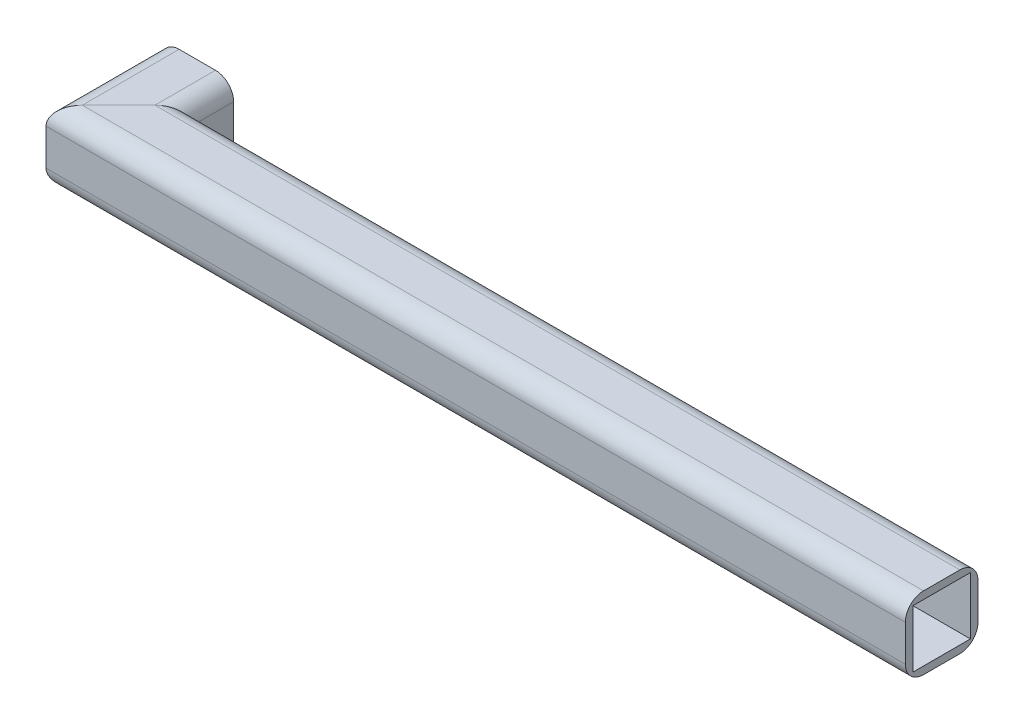
ISO-10303-21;
HEADER;
FILE_DESCRIPTION(('STEP AP214'),'2;1');
FILE_NAME('part.step','',(''),(''),'','','');
FILE_SCHEMA(('AUTOMOTIVE_DESIGN { 1 0 10303 214 1 1 1 1 }'));
ENDSEC;
DATA;
#1=APPLICATION_CONTEXT('core data for automotive mechanical design processes');
#2=APPLICATION_PROTOCOL_DEFINITION('international standard','automotive_design',2000,#1);
#3=PRODUCT_CONTEXT('',#1,'mechanical');
#4=PRODUCT('Part','Part','',(#3));
#5=PRODUCT_RELATED_PRODUCT_CATEGORY('part','',(#4));
#6=PRODUCT_DEFINITION_FORMATION('','',#4);
#7=PRODUCT_DEFINITION_CONTEXT('part definition',#1,'design');
#8=PRODUCT_DEFINITION('design','',#6,#7);
#9=PRODUCT_DEFINITION_SHAPE('','',#8);
#10=(LENGTH_UNIT() NAMED_UNIT(*) SI_UNIT(.MILLI.,.METRE.));
#11=(NAMED_UNIT(*) PLANE_ANGLE_UNIT() SI_UNIT($,.RADIAN.));
#12=(NAMED_UNIT(*) SI_UNIT($,.STERADIAN.) SOLID_ANGLE_UNIT());
#13=UNCERTAINTY_MEASURE_WITH_UNIT(LENGTH_MEASURE(1.E-05),#10,'distance_accuracy_value','');
#14=(GEOMETRIC_REPRESENTATION_CONTEXT(3) GLOBAL_UNCERTAINTY_ASSIGNED_CONTEXT((#13)) GLOBAL_UNIT_ASSIGNED_CONTEXT((#10,
#11,#12)) REPRESENTATION_CONTEXT('',''));
#15=CARTESIAN_POINT('',(0.,0.,0.));
#16=DIRECTION('',(0.,0.,1.));
#17=DIRECTION('',(1.,0.,0.));
#18=AXIS2_PLACEMENT_3D('',#15,#16,#17);
#19=CARTESIAN_POINT('',(-23.5950000000001,98.4249999999997,241.3));
#20=DIRECTION('',(0.,0.,1.));
#21=DIRECTION('',(0.,-1.,0.));
#22=AXIS2_PLACEMENT_3D('',#19,#20,#21);
#23=PLANE('',#22);
#24=DIRECTION('',(0.,1.,0.));
#25=VECTOR('',#24,1.);
#26=CARTESIAN_POINT('',(-15.875,98.4249999999997,241.3));
#27=LINE('',#26,#25);
#28=CARTESIAN_POINT('',(-15.875,22.2250000000003,241.3));
#29=VERTEX_POINT('',#28);
#30=CARTESIAN_POINT('',(-15.875,98.4249999999997,241.3));
#31=VERTEX_POINT('',#30);
#32=EDGE_CURVE('E199',#29,#31,#27,.T.);
#33=ORIENTED_EDGE('',*,*,#32,.F.);
#34=DIRECTION('',(1.,0.,0.));
#35=VECTOR('',#34,1.);
#36=CARTESIAN_POINT('',(-23.5950000000001,22.2250000000003,241.3));
#37=LINE('',#36,#35);
#38=CARTESIAN_POINT('',(1787.525,22.2250000000003,241.3));
#39=VERTEX_POINT('',#38);
#40=EDGE_CURVE('E155',#29,#39,#37,.T.);
#41=ORIENTED_EDGE('',*,*,#40,.T.);
#42=DIRECTION('',(0.,-1.,0.));
#43=VECTOR('',#42,1.);
#44=CARTESIAN_POINT('',(1787.525,98.4249999999997,241.3));
#45=LINE('',#44,#43);
#46=CARTESIAN_POINT('',(1787.525,98.4249999999997,241.3));
#47=VERTEX_POINT('',#46);
#48=EDGE_CURVE('E252',#47,#39,#45,.T.);
#49=ORIENTED_EDGE('',*,*,#48,.F.);
#50=DIRECTION('',(1.,0.,0.));
#51=VECTOR('',#50,1.);
#52=CARTESIAN_POINT('',(-23.5950000000001,98.4249999999997,241.3));
#53=LINE('',#52,#51);
#54=EDGE_CURVE('E39',#31,#47,#53,.T.);
#55=ORIENTED_EDGE('',*,*,#54,.F.);
#56=EDGE_LOOP('',(#33,#41,#49,#55));
#57=FACE_BOUND('',#56,.T.);
#58=ADVANCED_FACE('F35',(#57),#23,.T.);
#59=CARTESIAN_POINT('',(-23.5950000000001,22.225,203.2));
#60=DIRECTION('',(1.,0.,0.));
#61=DIRECTION('',(0.,0.,-1.));
#62=AXIS2_PLACEMENT_3D('',#59,#60,#61);
#63=CYLINDRICAL_SURFACE('',#62,38.1);
#64=CARTESIAN_POINT('',(22.225,22.225,203.2));
#65=DIRECTION('',(0.707106781186547,0.,0.707106781186547));
#66=DIRECTION('',(-0.707106781186548,0.,0.707106781186548));
#67=AXIS2_PLACEMENT_3D('',#64,#65,#66);
#68=ELLIPSE('',#67,53.8815367264149,38.1);
#69=CARTESIAN_POINT('',(22.2250000000003,-15.875,203.2));
#70=VERTEX_POINT('',#69);
#71=EDGE_CURVE('E150',#70,#29,#68,.F.);
#72=ORIENTED_EDGE('',*,*,#71,.F.);
#73=DIRECTION('',(1.,0.,0.));
#74=VECTOR('',#73,1.);
#75=CARTESIAN_POINT('',(-23.5950000000001,-15.875,203.2));
#76=LINE('',#75,#74);
#77=CARTESIAN_POINT('',(1787.525,-15.875,203.2));
#78=VERTEX_POINT('',#77);
#79=EDGE_CURVE('E152',#70,#78,#76,.T.);
#80=ORIENTED_EDGE('',*,*,#79,.T.);
#81=CARTESIAN_POINT('',(1787.525,22.225,203.2));
#82=DIRECTION('',(1.,0.,0.));
#83=DIRECTION('',(0.,0.,-1.));
#84=AXIS2_PLACEMENT_3D('',#81,#82,#83);
#85=CIRCLE('',#84,38.1);
#86=EDGE_CURVE('E160',#39,#78,#85,.T.);
#87=ORIENTED_EDGE('',*,*,#86,.F.);
#88=ORIENTED_EDGE('',*,*,#40,.F.);
#89=EDGE_LOOP('',(#72,#80,#87,#88));
#90=FACE_BOUND('',#89,.T.);
#91=ADVANCED_FACE('F151',(#90),#63,.T.);
#92=CARTESIAN_POINT('',(-23.5950000000001,-15.875,203.2));
#93=DIRECTION('',(0.,-1.,0.));
#94=DIRECTION('',(0.,0.,-1.));
#95=AXIS2_PLACEMENT_3D('',#92,#93,#94);
#96=PLANE('',#95);
#97=DIRECTION('',(-0.707106781186548,0.,0.707106781186548));
#98=VECTOR('',#97,1.);
#99=CARTESIAN_POINT('',(123.825,-15.875,101.6));
#100=LINE('',#99,#98);
#101=CARTESIAN_POINT('',(98.4249999999998,-15.875,127.));
#102=VERTEX_POINT('',#101);
#103=EDGE_CURVE('E143',#102,#70,#100,.T.);
#104=ORIENTED_EDGE('',*,*,#103,.F.);
#105=DIRECTION('',(1.,0.,0.));
#106=VECTOR('',#105,1.);
#107=CARTESIAN_POINT('',(-23.5950000000001,-15.875,127.));
#108=LINE('',#107,#106);
#109=CARTESIAN_POINT('',(1787.525,-15.875,127.));
#110=VERTEX_POINT('',#109);
#111=EDGE_CURVE('E165',#102,#110,#108,.T.);
#112=ORIENTED_EDGE('',*,*,#111,.T.);
#113=DIRECTION('',(0.,0.,-1.));
#114=VECTOR('',#113,1.);
#115=CARTESIAN_POINT('',(1787.525,-15.875,203.2));
#116=LINE('',#115,#114);
#117=EDGE_CURVE('E164',#78,#110,#116,.T.);
#118=ORIENTED_EDGE('',*,*,#117,.F.);
#119=ORIENTED_EDGE('',*,*,#79,.F.);
#120=EDGE_LOOP('',(#104,#112,#118,#119));
#121=FACE_BOUND('',#120,.T.);
#122=ADVANCED_FACE('F162',(#121),#96,.T.);
#123=CARTESIAN_POINT('',(-23.5950000000001,22.225,127.));
#124=DIRECTION('',(1.,0.,0.));
#125=DIRECTION('',(0.,0.,-1.));
#126=AXIS2_PLACEMENT_3D('',#123,#124,#125);
#127=CYLINDRICAL_SURFACE('',#126,38.1);
#128=CARTESIAN_POINT('',(98.425,22.225,127.));
#129=DIRECTION('',(0.707106781186547,0.,0.707106781186547));
#130=DIRECTION('',(-0.707106781186548,0.,0.707106781186548));
#131=AXIS2_PLACEMENT_3D('',#128,#129,#130);
#132=ELLIPSE('',#131,53.8815367264149,38.1);
#133=CARTESIAN_POINT('',(136.525,22.2250000000003,88.8999999999999));
#134=VERTEX_POINT('',#133);
#135=EDGE_CURVE('E175',#134,#102,#132,.F.);
#136=ORIENTED_EDGE('',*,*,#135,.F.);
#137=DIRECTION('',(1.,0.,0.));
#138=VECTOR('',#137,1.);
#139=CARTESIAN_POINT('',(-23.5950000000001,22.2250000000003,88.8999999999999));
#140=LINE('',#139,#138);
#141=CARTESIAN_POINT('',(1787.525,22.2250000000003,88.8999999999999));
#142=VERTEX_POINT('',#141);
#143=EDGE_CURVE('E212',#134,#142,#140,.T.);
#144=ORIENTED_EDGE('',*,*,#143,.T.);
#145=CARTESIAN_POINT('',(1787.525,22.225,127.));
#146=DIRECTION('',(1.,0.,0.));
#147=DIRECTION('',(0.,0.,-1.));
#148=AXIS2_PLACEMENT_3D('',#145,#146,#147);
#149=CIRCLE('',#148,38.1);
#150=EDGE_CURVE('E261',#110,#142,#149,.T.);
#151=ORIENTED_EDGE('',*,*,#150,.F.);
#152=ORIENTED_EDGE('',*,*,#111,.F.);
#153=EDGE_LOOP('',(#136,#144,#151,#152));
#154=FACE_BOUND('',#153,.T.);
#155=ADVANCED_FACE('F304',(#154),#127,.T.);
#156=CARTESIAN_POINT('',(-23.5950000000001,98.4249999999997,88.8999999999999));
#157=DIRECTION('',(0.,0.,-1.));
#158=DIRECTION('',(-1.,0.,0.));
#159=AXIS2_PLACEMENT_3D('',#156,#157,#158);
#160=PLANE('',#159);
#161=DIRECTION('',(0.,-1.,0.));
#162=VECTOR('',#161,1.);
#163=CARTESIAN_POINT('',(136.525,98.4249999999997,88.9));
#164=LINE('',#163,#162);
#165=CARTESIAN_POINT('',(136.525,98.4249999999998,88.8999999999999));
#166=VERTEX_POINT('',#165);
#167=EDGE_CURVE('E276',#166,#134,#164,.T.);
#168=ORIENTED_EDGE('',*,*,#167,.F.);
#169=DIRECTION('',(1.,0.,0.));
#170=VECTOR('',#169,1.);
#171=CARTESIAN_POINT('',(-23.5950000000001,98.4249999999998,88.8999999999999));
#172=LINE('',#171,#170);
#173=CARTESIAN_POINT('',(1787.525,98.4249999999998,88.8999999999999));
#174=VERTEX_POINT('',#173);
#175=EDGE_CURVE('E209',#166,#174,#172,.T.);
#176=ORIENTED_EDGE('',*,*,#175,.T.);
#177=DIRECTION('',(0.,1.,0.));
#178=VECTOR('',#177,1.);
#179=CARTESIAN_POINT('',(1787.525,98.4249999999997,88.8999999999999));
#180=LINE('',#179,#178);
#181=EDGE_CURVE('E264',#142,#174,#180,.T.);
#182=ORIENTED_EDGE('',*,*,#181,.F.);
#183=ORIENTED_EDGE('',*,*,#143,.F.);
#184=EDGE_LOOP('',(#168,#176,#182,#183));
#185=FACE_BOUND('',#184,.T.);
#186=ADVANCED_FACE('F306',(#185),#160,.T.);
#187=CARTESIAN_POINT('',(-23.5950000000001,98.425,127.));
#188=DIRECTION('',(1.,0.,0.));
#189=DIRECTION('',(0.,0.,-1.));
#190=AXIS2_PLACEMENT_3D('',#187,#188,#189);
#191=CYLINDRICAL_SURFACE('',#190,38.1);
#192=CARTESIAN_POINT('',(98.425,98.425,127.));
#193=DIRECTION('',(0.707106781186547,0.,0.707106781186547));
#194=DIRECTION('',(-0.707106781186548,0.,0.707106781186548));
#195=AXIS2_PLACEMENT_3D('',#192,#193,#194);
#196=ELLIPSE('',#195,53.8815367264149,38.1);
#197=CARTESIAN_POINT('',(98.4249999999998,136.525,127.));
#198=VERTEX_POINT('',#197);
#199=EDGE_CURVE('E279',#198,#166,#196,.F.);
#200=ORIENTED_EDGE('',*,*,#199,.F.);
#201=DIRECTION('',(1.,0.,0.));
#202=VECTOR('',#201,1.);
#203=CARTESIAN_POINT('',(-23.5950000000001,136.525,127.));
#204=LINE('',#203,#202);
#205=CARTESIAN_POINT('',(1787.525,136.525,127.));
#206=VERTEX_POINT('',#205);
#207=EDGE_CURVE('E206',#198,#206,#204,.T.);
#208=ORIENTED_EDGE('',*,*,#207,.T.);
#209=CARTESIAN_POINT('',(1787.525,98.425,127.));
#210=DIRECTION('',(1.,0.,0.));
#211=DIRECTION('',(0.,0.,1.));
#212=AXIS2_PLACEMENT_3D('',#209,#210,#211);
#213=CIRCLE('',#212,38.1);
#214=EDGE_CURVE('E269',#174,#206,#213,.T.);
#215=ORIENTED_EDGE('',*,*,#214,.F.);
#216=ORIENTED_EDGE('',*,*,#175,.F.);
#217=EDGE_LOOP('',(#200,#208,#215,#216));
#218=FACE_BOUND('',#217,.T.);
#219=ADVANCED_FACE('F379',(#218),#191,.T.);
#220=CARTESIAN_POINT('',(-23.5950000000001,136.525,203.2));
#221=DIRECTION('',(0.,1.,0.));
#222=DIRECTION('',(0.,0.,1.));
#223=AXIS2_PLACEMENT_3D('',#220,#221,#222);
#224=PLANE('',#223);
#225=DIRECTION('',(0.707106781186548,0.,-0.707106781186548));
#226=VECTOR('',#225,1.);
#227=CARTESIAN_POINT('',(123.825,136.525,101.6));
#228=LINE('',#227,#226);
#229=CARTESIAN_POINT('',(22.2250000000003,136.525,203.2));
#230=VERTEX_POINT('',#229);
#231=EDGE_CURVE('E282',#230,#198,#228,.T.);
#232=ORIENTED_EDGE('',*,*,#231,.F.);
#233=DIRECTION('',(1.,0.,0.));
#234=VECTOR('',#233,1.);
#235=CARTESIAN_POINT('',(-23.5950000000001,136.525,203.2));
#236=LINE('',#235,#234);
#237=CARTESIAN_POINT('',(1787.525,136.525,203.2));
#238=VERTEX_POINT('',#237);
#239=EDGE_CURVE('E203',#230,#238,#236,.T.);
#240=ORIENTED_EDGE('',*,*,#239,.T.);
#241=DIRECTION('',(0.,0.,1.));
#242=VECTOR('',#241,1.);
#243=CARTESIAN_POINT('',(1787.525,136.525,203.2));
#244=LINE('',#243,#242);
#245=EDGE_CURVE('E260',#206,#238,#244,.T.);
#246=ORIENTED_EDGE('',*,*,#245,.F.);
#247=ORIENTED_EDGE('',*,*,#207,.F.);
#248=EDGE_LOOP('',(#232,#240,#246,#247));
#249=FACE_BOUND('',#248,.T.);
#250=ADVANCED_FACE('F375',(#249),#224,.T.);
#251=CARTESIAN_POINT('',(-23.5950000000001,98.425,203.2));
#252=DIRECTION('',(1.,0.,0.));
#253=DIRECTION('',(0.,0.,-1.));
#254=AXIS2_PLACEMENT_3D('',#251,#252,#253);
#255=CYLINDRICAL_SURFACE('',#254,38.1);
#256=CARTESIAN_POINT('',(22.225,98.425,203.2));
#257=DIRECTION('',(0.707106781186547,0.,0.707106781186547));
#258=DIRECTION('',(-0.707106781186548,0.,0.707106781186548));
#259=AXIS2_PLACEMENT_3D('',#256,#257,#258);
#260=ELLIPSE('',#259,53.8815367264149,38.1);
#261=EDGE_CURVE('E202',#31,#230,#260,.F.);
#262=ORIENTED_EDGE('',*,*,#261,.F.);
#263=ORIENTED_EDGE('',*,*,#54,.T.);
#264=CARTESIAN_POINT('',(1787.525,98.425,203.2));
#265=DIRECTION('',(1.,0.,0.));
#266=DIRECTION('',(0.,0.,-1.));
#267=AXIS2_PLACEMENT_3D('',#264,#265,#266);
#268=CIRCLE('',#267,38.1);
#269=EDGE_CURVE('E258',#238,#47,#268,.T.);
#270=ORIENTED_EDGE('',*,*,#269,.F.);
#271=ORIENTED_EDGE('',*,*,#239,.F.);
#272=EDGE_LOOP('',(#262,#263,#270,#271));
#273=FACE_BOUND('',#272,.T.);
#274=ADVANCED_FACE('F37',(#273),#255,.T.);
#275=CARTESIAN_POINT('',(22.225,98.425,0.));
#276=DIRECTION('',(0.,0.,1.));
#277=DIRECTION('',(1.,0.,0.));
#278=AXIS2_PLACEMENT_3D('',#275,#276,#277);
#279=CYLINDRICAL_SURFACE('',#278,38.1);
#280=DIRECTION('',(0.,0.,1.));
#281=VECTOR('',#280,1.);
#282=CARTESIAN_POINT('',(-15.875,98.4249999999997,0.));
#283=LINE('',#282,#281);
#284=CARTESIAN_POINT('',(-15.875,98.4249999999997,0.));
#285=VERTEX_POINT('',#284);
#286=EDGE_CURVE('E184',#285,#31,#283,.T.);
#287=ORIENTED_EDGE('',*,*,#286,.T.);
#288=ORIENTED_EDGE('',*,*,#261,.T.);
#289=DIRECTION('',(0.,0.,1.));
#290=VECTOR('',#289,1.);
#291=CARTESIAN_POINT('',(22.2250000000003,136.525,0.));
#292=LINE('',#291,#290);
#293=CARTESIAN_POINT('',(22.2250000000003,136.525,0.));
#294=VERTEX_POINT('',#293);
#295=EDGE_CURVE('E196',#294,#230,#292,.T.);
#296=ORIENTED_EDGE('',*,*,#295,.F.);
#297=CARTESIAN_POINT('',(22.225,98.425,0.));
#298=DIRECTION('',(0.,0.,1.));
#299=DIRECTION('',(1.,0.,0.));
#300=AXIS2_PLACEMENT_3D('',#297,#298,#299);
#301=CIRCLE('',#300,38.1);
#302=EDGE_CURVE('E228',#294,#285,#301,.T.);
#303=ORIENTED_EDGE('',*,*,#302,.T.);
#304=EDGE_LOOP('',(#287,#288,#296,#303));
#305=FACE_BOUND('',#304,.T.);
#306=ADVANCED_FACE('F225',(#305),#279,.T.);
#307=CARTESIAN_POINT('',(22.2250000000003,136.525,0.));
#308=DIRECTION('',(0.,1.,0.));
#309=DIRECTION('',(0.,0.,1.));
#310=AXIS2_PLACEMENT_3D('',#307,#308,#309);
#311=PLANE('',#310);
#312=ORIENTED_EDGE('',*,*,#295,.T.);
#313=ORIENTED_EDGE('',*,*,#231,.T.);
#314=DIRECTION('',(0.,0.,1.));
#315=VECTOR('',#314,1.);
#316=CARTESIAN_POINT('',(98.4249999999998,136.525,0.));
#317=LINE('',#316,#315);
#318=CARTESIAN_POINT('',(98.4249999999998,136.525,0.));
#319=VERTEX_POINT('',#318);
#320=EDGE_CURVE('E193',#319,#198,#317,.T.);
#321=ORIENTED_EDGE('',*,*,#320,.F.);
#322=DIRECTION('',(-1.,0.,0.));
#323=VECTOR('',#322,1.);
#324=CARTESIAN_POINT('',(22.2250000000003,136.525,0.));
#325=LINE('',#324,#323);
#326=EDGE_CURVE('E240',#319,#294,#325,.T.);
#327=ORIENTED_EDGE('',*,*,#326,.T.);
#328=EDGE_LOOP('',(#312,#313,#321,#327));
#329=FACE_BOUND('',#328,.T.);
#330=ADVANCED_FACE('F287',(#329),#311,.T.);
#331=CARTESIAN_POINT('',(98.425,98.425,0.));
#332=DIRECTION('',(0.,0.,1.));
#333=DIRECTION('',(1.,0.,0.));
#334=AXIS2_PLACEMENT_3D('',#331,#332,#333);
#335=CYLINDRICAL_SURFACE('',#334,38.1);
#336=ORIENTED_EDGE('',*,*,#320,.T.);
#337=ORIENTED_EDGE('',*,*,#199,.T.);
#338=DIRECTION('',(0.,0.,1.));
#339=VECTOR('',#338,1.);
#340=CARTESIAN_POINT('',(136.525,98.4249999999998,0.));
#341=LINE('',#340,#339);
#342=CARTESIAN_POINT('',(136.525,98.4249999999998,0.));
#343=VERTEX_POINT('',#342);
#344=EDGE_CURVE('E190',#343,#166,#341,.T.);
#345=ORIENTED_EDGE('',*,*,#344,.F.);
#346=CARTESIAN_POINT('',(98.425,98.425,0.));
#347=DIRECTION('',(0.,0.,1.));
#348=DIRECTION('',(-1.,0.,0.));
#349=AXIS2_PLACEMENT_3D('',#346,#347,#348);
#350=CIRCLE('',#349,38.1);
#351=EDGE_CURVE('E254',#343,#319,#350,.T.);
#352=ORIENTED_EDGE('',*,*,#351,.T.);
#353=EDGE_LOOP('',(#336,#337,#345,#352));
#354=FACE_BOUND('',#353,.T.);
#355=ADVANCED_FACE('F292',(#354),#335,.T.);
#356=CARTESIAN_POINT('',(136.525,98.4249999999997,0.));
#357=DIRECTION('',(1.,0.,0.));
#358=DIRECTION('',(0.,0.,-1.));
#359=AXIS2_PLACEMENT_3D('',#356,#357,#358);
#360=PLANE('',#359);
#361=ORIENTED_EDGE('',*,*,#344,.T.);
#362=ORIENTED_EDGE('',*,*,#167,.T.);
#363=DIRECTION('',(0.,0.,1.));
#364=VECTOR('',#363,1.);
#365=CARTESIAN_POINT('',(136.525,22.2250000000003,0.));
#366=LINE('',#365,#364);
#367=CARTESIAN_POINT('',(136.525,22.2250000000003,0.));
#368=VERTEX_POINT('',#367);
#369=EDGE_CURVE('E182',#368,#134,#366,.T.);
#370=ORIENTED_EDGE('',*,*,#369,.F.);
#371=DIRECTION('',(0.,1.,0.));
#372=VECTOR('',#371,1.);
#373=CARTESIAN_POINT('',(136.525,98.4249999999997,0.));
#374=LINE('',#373,#372);
#375=EDGE_CURVE('E248',#368,#343,#374,.T.);
#376=ORIENTED_EDGE('',*,*,#375,.T.);
#377=EDGE_LOOP('',(#361,#362,#370,#376));
#378=FACE_BOUND('',#377,.T.);
#379=ADVANCED_FACE('F299',(#378),#360,.T.);
#380=CARTESIAN_POINT('',(98.425,22.225,0.));
#381=DIRECTION('',(0.,0.,1.));
#382=DIRECTION('',(1.,0.,0.));
#383=AXIS2_PLACEMENT_3D('',#380,#381,#382);
#384=CYLINDRICAL_SURFACE('',#383,38.1);
#385=ORIENTED_EDGE('',*,*,#369,.T.);
#386=ORIENTED_EDGE('',*,*,#135,.T.);
#387=DIRECTION('',(0.,0.,1.));
#388=VECTOR('',#387,1.);
#389=CARTESIAN_POINT('',(98.4249999999998,-15.875,0.));
#390=LINE('',#389,#388);
#391=CARTESIAN_POINT('',(98.4249999999998,-15.875,0.));
#392=VERTEX_POINT('',#391);
#393=EDGE_CURVE('E174',#392,#102,#390,.T.);
#394=ORIENTED_EDGE('',*,*,#393,.F.);
#395=CARTESIAN_POINT('',(98.425,22.225,0.));
#396=DIRECTION('',(0.,0.,1.));
#397=DIRECTION('',(1.,0.,0.));
#398=AXIS2_PLACEMENT_3D('',#395,#396,#397);
#399=CIRCLE('',#398,38.1);
#400=EDGE_CURVE('E246',#392,#368,#399,.T.);
#401=ORIENTED_EDGE('',*,*,#400,.T.);
#402=EDGE_LOOP('',(#385,#386,#394,#401));
#403=FACE_BOUND('',#402,.T.);
#404=ADVANCED_FACE('F301',(#403),#384,.T.);
#405=CARTESIAN_POINT('',(22.2250000000003,-15.875,0.));
#406=DIRECTION('',(0.,-1.,0.));
#407=DIRECTION('',(0.,0.,-1.));
#408=AXIS2_PLACEMENT_3D('',#405,#406,#407);
#409=PLANE('',#408);
#410=ORIENTED_EDGE('',*,*,#393,.T.);
#411=ORIENTED_EDGE('',*,*,#103,.T.);
#412=DIRECTION('',(0.,0.,1.));
#413=VECTOR('',#412,1.);
#414=CARTESIAN_POINT('',(22.2250000000003,-15.875,0.));
#415=LINE('',#414,#413);
#416=CARTESIAN_POINT('',(22.2250000000003,-15.875,0.));
#417=VERTEX_POINT('',#416);
#418=EDGE_CURVE('E171',#417,#70,#415,.T.);
#419=ORIENTED_EDGE('',*,*,#418,.F.);
#420=DIRECTION('',(1.,0.,0.));
#421=VECTOR('',#420,1.);
#422=CARTESIAN_POINT('',(22.2250000000003,-15.875,0.));
#423=LINE('',#422,#421);
#424=EDGE_CURVE('E249',#417,#392,#423,.T.);
#425=ORIENTED_EDGE('',*,*,#424,.T.);
#426=EDGE_LOOP('',(#410,#411,#419,#425));
#427=FACE_BOUND('',#426,.T.);
#428=ADVANCED_FACE('F170',(#427),#409,.T.);
#429=CARTESIAN_POINT('',(22.225,22.225,0.));
#430=DIRECTION('',(0.,0.,1.));
#431=DIRECTION('',(1.,0.,0.));
#432=AXIS2_PLACEMENT_3D('',#429,#430,#431);
#433=CYLINDRICAL_SURFACE('',#432,38.1);
#434=ORIENTED_EDGE('',*,*,#418,.T.);
#435=ORIENTED_EDGE('',*,*,#71,.T.);
#436=DIRECTION('',(0.,0.,1.));
#437=VECTOR('',#436,1.);
#438=CARTESIAN_POINT('',(-15.875,22.2250000000003,0.));
#439=LINE('',#438,#437);
#440=CARTESIAN_POINT('',(-15.875,22.2250000000003,0.));
#441=VERTEX_POINT('',#440);
#442=EDGE_CURVE('E180',#441,#29,#439,.T.);
#443=ORIENTED_EDGE('',*,*,#442,.F.);
#444=CARTESIAN_POINT('',(22.225,22.225,0.));
#445=DIRECTION('',(0.,0.,1.));
#446=DIRECTION('',(1.,0.,0.));
#447=AXIS2_PLACEMENT_3D('',#444,#445,#446);
#448=CIRCLE('',#447,38.1);
#449=EDGE_CURVE('E179',#441,#417,#448,.T.);
#450=ORIENTED_EDGE('',*,*,#449,.T.);
#451=EDGE_LOOP('',(#434,#435,#443,#450));
#452=FACE_BOUND('',#451,.T.);
#453=ADVANCED_FACE('F177',(#452),#433,.T.);
#454=CARTESIAN_POINT('',(-15.875,98.4249999999997,0.));
#455=DIRECTION('',(-1.,0.,0.));
#456=DIRECTION('',(0.,-1.,0.));
#457=AXIS2_PLACEMENT_3D('',#454,#455,#456);
#458=PLANE('',#457);
#459=ORIENTED_EDGE('',*,*,#442,.T.);
#460=ORIENTED_EDGE('',*,*,#32,.T.);
#461=ORIENTED_EDGE('',*,*,#286,.F.);
#462=DIRECTION('',(0.,-1.,0.));
#463=VECTOR('',#462,1.);
#464=CARTESIAN_POINT('',(-15.875,98.4249999999997,0.));
#465=LINE('',#464,#463);
#466=EDGE_CURVE('E232',#285,#441,#465,.T.);
#467=ORIENTED_EDGE('',*,*,#466,.T.);
#468=EDGE_LOOP('',(#459,#460,#461,#467));
#469=FACE_BOUND('',#468,.T.);
#470=ADVANCED_FACE('F231',(#469),#458,.T.);
#471=CARTESIAN_POINT('',(1787.525,22.225,203.2));
#472=DIRECTION('',(1.,0.,0.));
#473=DIRECTION('',(0.,0.,-1.));
#474=AXIS2_PLACEMENT_3D('',#471,#472,#473);
#475=PLANE('',#474);
#476=DIRECTION('',(0.,0.,-1.));
#477=VECTOR('',#476,1.);
#478=CARTESIAN_POINT('',(1787.525,0.,225.425));
#479=LINE('',#478,#477);
#480=CARTESIAN_POINT('',(1787.525,0.,104.775));
#481=VERTEX_POINT('',#480);
#482=CARTESIAN_POINT('',(1787.525,0.,225.425));
#483=VERTEX_POINT('',#482);
#484=EDGE_CURVE('E236',#481,#483,#479,.F.);
#485=ORIENTED_EDGE('',*,*,#484,.T.);
#486=DIRECTION('',(0.,-1.,0.));
#487=VECTOR('',#486,1.);
#488=CARTESIAN_POINT('',(1787.525,120.65,225.425));
#489=LINE('',#488,#487);
#490=CARTESIAN_POINT('',(1787.525,120.65,225.425));
#491=VERTEX_POINT('',#490);
#492=EDGE_CURVE('E539',#483,#491,#489,.F.);
#493=ORIENTED_EDGE('',*,*,#492,.T.);
#494=DIRECTION('',(0.,0.,1.));
#495=VECTOR('',#494,1.);
#496=CARTESIAN_POINT('',(1787.525,120.65,104.775));
#497=LINE('',#496,#495);
#498=CARTESIAN_POINT('',(1787.525,120.65,104.775));
#499=VERTEX_POINT('',#498);
#500=EDGE_CURVE('E551',#491,#499,#497,.F.);
#501=ORIENTED_EDGE('',*,*,#500,.T.);
#502=DIRECTION('',(0.,1.,0.));
#503=VECTOR('',#502,1.);
#504=CARTESIAN_POINT('',(1787.525,0.,104.775));
#505=LINE('',#504,#503);
#506=EDGE_CURVE('E238',#499,#481,#505,.F.);
#507=ORIENTED_EDGE('',*,*,#506,.T.);
#508=EDGE_LOOP('',(#485,#493,#501,#507));
#509=FACE_BOUND('',#508,.T.);
#510=ORIENTED_EDGE('',*,*,#86,.T.);
#511=ORIENTED_EDGE('',*,*,#117,.T.);
#512=ORIENTED_EDGE('',*,*,#150,.T.);
#513=ORIENTED_EDGE('',*,*,#181,.T.);
#514=ORIENTED_EDGE('',*,*,#214,.T.);
#515=ORIENTED_EDGE('',*,*,#245,.T.);
#516=ORIENTED_EDGE('',*,*,#269,.T.);
#517=ORIENTED_EDGE('',*,*,#48,.T.);
#518=EDGE_LOOP('',(#510,#511,#512,#513,#514,#515,#516,#517));
#519=FACE_BOUND('',#518,.T.);
#520=ADVANCED_FACE('F309',(#509,#519),#475,.T.);
#521=CARTESIAN_POINT('',(22.225,22.225,0.));
#522=DIRECTION('',(0.,0.,1.));
#523=DIRECTION('',(1.,0.,0.));
#524=AXIS2_PLACEMENT_3D('',#521,#522,#523);
#525=PLANE('',#524);
#526=DIRECTION('',(1.,0.,0.));
#527=VECTOR('',#526,1.);
#528=CARTESIAN_POINT('',(0.,0.,0.));
#529=LINE('',#528,#527);
#530=CARTESIAN_POINT('',(120.65,0.,0.));
#531=VERTEX_POINT('',#530);
#532=CARTESIAN_POINT('',(0.,0.,0.));
#533=VERTEX_POINT('',#532);
#534=EDGE_CURVE('E569',#531,#533,#529,.F.);
#535=ORIENTED_EDGE('',*,*,#534,.F.);
#536=DIRECTION('',(0.,1.,0.));
#537=VECTOR('',#536,1.);
#538=CARTESIAN_POINT('',(120.65,0.,0.));
#539=LINE('',#538,#537);
#540=CARTESIAN_POINT('',(120.65,120.65,0.));
#541=VERTEX_POINT('',#540);
#542=EDGE_CURVE('E573',#541,#531,#539,.F.);
#543=ORIENTED_EDGE('',*,*,#542,.F.);
#544=DIRECTION('',(-1.,0.,0.));
#545=VECTOR('',#544,1.);
#546=CARTESIAN_POINT('',(120.65,120.65,0.));
#547=LINE('',#546,#545);
#548=CARTESIAN_POINT('',(0.,120.65,0.));
#549=VERTEX_POINT('',#548);
#550=EDGE_CURVE('E558',#549,#541,#547,.F.);
#551=ORIENTED_EDGE('',*,*,#550,.F.);
#552=DIRECTION('',(0.,-1.,0.));
#553=VECTOR('',#552,1.);
#554=CARTESIAN_POINT('',(0.,120.65,0.));
#555=LINE('',#554,#553);
#556=EDGE_CURVE('E556',#533,#549,#555,.F.);
#557=ORIENTED_EDGE('',*,*,#556,.F.);
#558=EDGE_LOOP('',(#535,#543,#551,#557));
#559=FACE_BOUND('',#558,.T.);
#560=ORIENTED_EDGE('',*,*,#449,.F.);
#561=ORIENTED_EDGE('',*,*,#466,.F.);
#562=ORIENTED_EDGE('',*,*,#302,.F.);
#563=ORIENTED_EDGE('',*,*,#326,.F.);
#564=ORIENTED_EDGE('',*,*,#351,.F.);
#565=ORIENTED_EDGE('',*,*,#375,.F.);
#566=ORIENTED_EDGE('',*,*,#400,.F.);
#567=ORIENTED_EDGE('',*,*,#424,.F.);
#568=EDGE_LOOP('',(#560,#561,#562,#563,#564,#565,#566,#567));
#569=FACE_BOUND('',#568,.T.);
#570=ADVANCED_FACE('F234',(#559,#569),#525,.F.);
#571=CARTESIAN_POINT('',(-6.13249999999997,120.65,225.425));
#572=DIRECTION('',(0.,0.,-1.));
#573=DIRECTION('',(0.,1.,0.));
#574=AXIS2_PLACEMENT_3D('',#571,#572,#573);
#575=PLANE('',#574);
#576=DIRECTION('',(0.,-1.,0.));
#577=VECTOR('',#576,1.);
#578=CARTESIAN_POINT('',(0.,120.65,225.425));
#579=LINE('',#578,#577);
#580=CARTESIAN_POINT('',(0.,120.65,225.425));
#581=VERTEX_POINT('',#580);
#582=CARTESIAN_POINT('',(0.,0.,225.425));
#583=VERTEX_POINT('',#582);
#584=EDGE_CURVE('E566',#581,#583,#579,.T.);
#585=ORIENTED_EDGE('',*,*,#584,.F.);
#586=DIRECTION('',(1.,0.,0.));
#587=VECTOR('',#586,1.);
#588=CARTESIAN_POINT('',(-6.13249999999997,120.65,225.425));
#589=LINE('',#588,#587);
#590=EDGE_CURVE('E549',#581,#491,#589,.T.);
#591=ORIENTED_EDGE('',*,*,#590,.T.);
#592=ORIENTED_EDGE('',*,*,#492,.F.);
#593=DIRECTION('',(1.,0.,0.));
#594=VECTOR('',#593,1.);
#595=CARTESIAN_POINT('',(-6.13249999999997,0.,225.425));
#596=LINE('',#595,#594);
#597=EDGE_CURVE('E243',#583,#483,#596,.T.);
#598=ORIENTED_EDGE('',*,*,#597,.F.);
#599=EDGE_LOOP('',(#585,#591,#592,#598));
#600=FACE_BOUND('',#599,.T.);
#601=ADVANCED_FACE('F338',(#600),#575,.T.);
#602=CARTESIAN_POINT('',(-6.13249999999996,120.65,104.775));
#603=DIRECTION('',(0.,-1.,0.));
#604=DIRECTION('',(0.,0.,-1.));
#605=AXIS2_PLACEMENT_3D('',#602,#603,#604);
#606=PLANE('',#605);
#607=DIRECTION('',(-0.707106781186548,0.,0.707106781186548));
#608=VECTOR('',#607,1.);
#609=CARTESIAN_POINT('',(173.0375,120.65,52.3875));
#610=LINE('',#609,#608);
#611=CARTESIAN_POINT('',(120.65,120.65,104.775));
#612=VERTEX_POINT('',#611);
#613=EDGE_CURVE('E11',#612,#581,#610,.T.);
#614=ORIENTED_EDGE('',*,*,#613,.F.);
#615=DIRECTION('',(1.,0.,0.));
#616=VECTOR('',#615,1.);
#617=CARTESIAN_POINT('',(-6.13249999999996,120.65,104.775));
#618=LINE('',#617,#616);
#619=EDGE_CURVE('E560',#612,#499,#618,.T.);
#620=ORIENTED_EDGE('',*,*,#619,.T.);
#621=ORIENTED_EDGE('',*,*,#500,.F.);
#622=ORIENTED_EDGE('',*,*,#590,.F.);
#623=EDGE_LOOP('',(#614,#620,#621,#622));
#624=FACE_BOUND('',#623,.T.);
#625=ADVANCED_FACE('F341',(#624),#606,.T.);
#626=CARTESIAN_POINT('',(-6.13249999999996,0.,104.775));
#627=DIRECTION('',(0.,0.,1.));
#628=DIRECTION('',(0.,-1.,0.));
#629=AXIS2_PLACEMENT_3D('',#626,#627,#628);
#630=PLANE('',#629);
#631=DIRECTION('',(0.,1.,0.));
#632=VECTOR('',#631,1.);
#633=CARTESIAN_POINT('',(120.65,0.,104.775));
#634=LINE('',#633,#632);
#635=CARTESIAN_POINT('',(120.65,0.,104.775));
#636=VERTEX_POINT('',#635);
#637=EDGE_CURVE('E45',#636,#612,#634,.T.);
#638=ORIENTED_EDGE('',*,*,#637,.F.);
#639=DIRECTION('',(1.,0.,0.));
#640=VECTOR('',#639,1.);
#641=CARTESIAN_POINT('',(-6.13249999999996,0.,104.775));
#642=LINE('',#641,#640);
#643=EDGE_CURVE('E550',#636,#481,#642,.T.);
#644=ORIENTED_EDGE('',*,*,#643,.T.);
#645=ORIENTED_EDGE('',*,*,#506,.F.);
#646=ORIENTED_EDGE('',*,*,#619,.F.);
#647=EDGE_LOOP('',(#638,#644,#645,#646));
#648=FACE_BOUND('',#647,.T.);
#649=ADVANCED_FACE('F345',(#648),#630,.T.);
#650=CARTESIAN_POINT('',(-6.13249999999997,0.,225.425));
#651=DIRECTION('',(0.,1.,0.));
#652=DIRECTION('',(0.,0.,1.));
#653=AXIS2_PLACEMENT_3D('',#650,#651,#652);
#654=PLANE('',#653);
#655=DIRECTION('',(0.707106781186548,0.,-0.707106781186548));
#656=VECTOR('',#655,1.);
#657=CARTESIAN_POINT('',(112.7125,0.,112.7125));
#658=LINE('',#657,#656);
#659=EDGE_CURVE('E555',#583,#636,#658,.T.);
#660=ORIENTED_EDGE('',*,*,#659,.F.);
#661=ORIENTED_EDGE('',*,*,#597,.T.);
#662=ORIENTED_EDGE('',*,*,#484,.F.);
#663=ORIENTED_EDGE('',*,*,#643,.F.);
#664=EDGE_LOOP('',(#660,#661,#662,#663));
#665=FACE_BOUND('',#664,.T.);
#666=ADVANCED_FACE('F336',(#665),#654,.T.);
#667=CARTESIAN_POINT('',(0.,0.,0.));
#668=DIRECTION('',(0.,1.,0.));
#669=DIRECTION('',(0.,0.,1.));
#670=AXIS2_PLACEMENT_3D('',#667,#668,#669);
#671=PLANE('',#670);
#672=DIRECTION('',(0.,0.,1.));
#673=VECTOR('',#672,1.);
#674=CARTESIAN_POINT('',(0.,0.,0.));
#675=LINE('',#674,#673);
#676=EDGE_CURVE('E572',#533,#583,#675,.T.);
#677=ORIENTED_EDGE('',*,*,#676,.T.);
#678=ORIENTED_EDGE('',*,*,#659,.T.);
#679=DIRECTION('',(0.,0.,1.));
#680=VECTOR('',#679,1.);
#681=CARTESIAN_POINT('',(120.65,0.,0.));
#682=LINE('',#681,#680);
#683=EDGE_CURVE('E568',#531,#636,#682,.T.);
#684=ORIENTED_EDGE('',*,*,#683,.F.);
#685=ORIENTED_EDGE('',*,*,#534,.T.);
#686=EDGE_LOOP('',(#677,#678,#684,#685));
#687=FACE_BOUND('',#686,.T.);
#688=ADVANCED_FACE('F332',(#687),#671,.T.);
#689=CARTESIAN_POINT('',(120.65,0.,0.));
#690=DIRECTION('',(-1.,0.,0.));
#691=DIRECTION('',(0.,-1.,0.));
#692=AXIS2_PLACEMENT_3D('',#689,#690,#691);
#693=PLANE('',#692);
#694=ORIENTED_EDGE('',*,*,#683,.T.);
#695=ORIENTED_EDGE('',*,*,#637,.T.);
#696=DIRECTION('',(0.,0.,1.));
#697=VECTOR('',#696,1.);
#698=CARTESIAN_POINT('',(120.65,120.65,0.));
#699=LINE('',#698,#697);
#700=EDGE_CURVE('E576',#541,#612,#699,.T.);
#701=ORIENTED_EDGE('',*,*,#700,.F.);
#702=ORIENTED_EDGE('',*,*,#542,.T.);
#703=EDGE_LOOP('',(#694,#695,#701,#702));
#704=FACE_BOUND('',#703,.T.);
#705=ADVANCED_FACE('F325',(#704),#693,.T.);
#706=CARTESIAN_POINT('',(120.65,120.65,0.));
#707=DIRECTION('',(0.,-1.,0.));
#708=DIRECTION('',(0.,0.,-1.));
#709=AXIS2_PLACEMENT_3D('',#706,#707,#708);
#710=PLANE('',#709);
#711=ORIENTED_EDGE('',*,*,#700,.T.);
#712=ORIENTED_EDGE('',*,*,#613,.T.);
#713=DIRECTION('',(0.,0.,1.));
#714=VECTOR('',#713,1.);
#715=CARTESIAN_POINT('',(0.,120.65,0.));
#716=LINE('',#715,#714);
#717=EDGE_CURVE('E581',#549,#581,#716,.T.);
#718=ORIENTED_EDGE('',*,*,#717,.F.);
#719=ORIENTED_EDGE('',*,*,#550,.T.);
#720=EDGE_LOOP('',(#711,#712,#718,#719));
#721=FACE_BOUND('',#720,.T.);
#722=ADVANCED_FACE('F319',(#721),#710,.T.);
#723=CARTESIAN_POINT('',(0.,120.65,0.));
#724=DIRECTION('',(1.,0.,0.));
#725=DIRECTION('',(0.,1.,0.));
#726=AXIS2_PLACEMENT_3D('',#723,#724,#725);
#727=PLANE('',#726);
#728=ORIENTED_EDGE('',*,*,#717,.T.);
#729=ORIENTED_EDGE('',*,*,#584,.T.);
#730=ORIENTED_EDGE('',*,*,#676,.F.);
#731=ORIENTED_EDGE('',*,*,#556,.T.);
#732=EDGE_LOOP('',(#728,#729,#730,#731));
#733=FACE_BOUND('',#732,.T.);
#734=ADVANCED_FACE('F317',(#733),#727,.T.);
#735=CLOSED_SHELL('',(#58,#91,#122,#155,#186,#219,#250,#274,#306,#330,#355,#379,#404,#428,#453,
#470,#520,#570,#601,#625,#649,#666,#688,#705,#722,#734));
#736=MANIFOLD_SOLID_BREP('B2',#735);
#737=ADVANCED_BREP_SHAPE_REPRESENTATION('',(#18,#736),#14);
#738=SHAPE_DEFINITION_REPRESENTATION(#9,#737);
ENDSEC;
END-ISO-10303-21;
